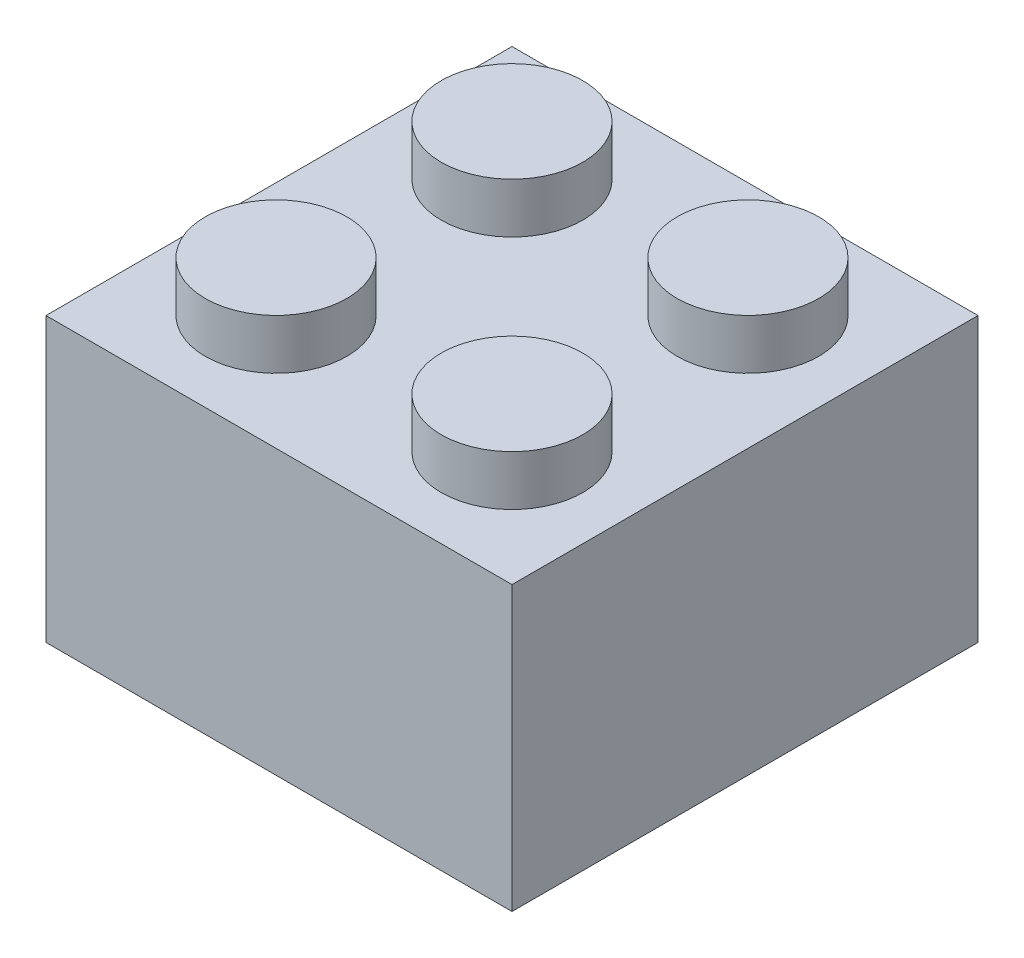
ISO-10303-21;
HEADER;
FILE_DESCRIPTION(('STEP AP214'),'2;1');
FILE_NAME('part.step','',(''),(''),'','','');
FILE_SCHEMA(('AUTOMOTIVE_DESIGN { 1 0 10303 214 1 1 1 1 }'));
ENDSEC;
DATA;
#1=APPLICATION_CONTEXT('core data for automotive mechanical design processes');
#2=APPLICATION_PROTOCOL_DEFINITION('international standard','automotive_design',2000,#1);
#3=PRODUCT_CONTEXT('',#1,'mechanical');
#4=PRODUCT('Part','Part','',(#3));
#5=PRODUCT_RELATED_PRODUCT_CATEGORY('part','',(#4));
#6=PRODUCT_DEFINITION_FORMATION('','',#4);
#7=PRODUCT_DEFINITION_CONTEXT('part definition',#1,'design');
#8=PRODUCT_DEFINITION('design','',#6,#7);
#9=PRODUCT_DEFINITION_SHAPE('','',#8);
#10=(LENGTH_UNIT() NAMED_UNIT(*) SI_UNIT(.MILLI.,.METRE.));
#11=(NAMED_UNIT(*) PLANE_ANGLE_UNIT() SI_UNIT($,.RADIAN.));
#12=(NAMED_UNIT(*) SI_UNIT($,.STERADIAN.) SOLID_ANGLE_UNIT());
#13=UNCERTAINTY_MEASURE_WITH_UNIT(LENGTH_MEASURE(1.E-05),#10,'distance_accuracy_value','');
#14=(GEOMETRIC_REPRESENTATION_CONTEXT(3) GLOBAL_UNCERTAINTY_ASSIGNED_CONTEXT((#13)) GLOBAL_UNIT_ASSIGNED_CONTEXT((#10,
#11,#12)) REPRESENTATION_CONTEXT('',''));
#15=CARTESIAN_POINT('',(0.,0.,0.));
#16=DIRECTION('',(0.,0.,1.));
#17=DIRECTION('',(1.,0.,0.));
#18=AXIS2_PLACEMENT_3D('',#15,#16,#17);
#19=CARTESIAN_POINT('',(0.,9.6,-15.8));
#20=DIRECTION('',(0.,0.,-1.));
#21=DIRECTION('',(-1.,0.,0.));
#22=AXIS2_PLACEMENT_3D('',#19,#20,#21);
#23=PLANE('',#22);
#24=DIRECTION('',(1.,0.,0.));
#25=VECTOR('',#24,1.);
#26=CARTESIAN_POINT('',(0.,0.,-15.8));
#27=LINE('',#26,#25);
#28=CARTESIAN_POINT('',(0.,0.,-15.8));
#29=VERTEX_POINT('',#28);
#30=CARTESIAN_POINT('',(15.8,0.,-15.8));
#31=VERTEX_POINT('',#30);
#32=EDGE_CURVE('E101',#29,#31,#27,.T.);
#33=ORIENTED_EDGE('',*,*,#32,.F.);
#34=DIRECTION('',(0.,-1.,0.));
#35=VECTOR('',#34,1.);
#36=CARTESIAN_POINT('',(0.,9.6,-15.8));
#37=LINE('',#36,#35);
#38=CARTESIAN_POINT('',(0.,9.6,-15.8));
#39=VERTEX_POINT('',#38);
#40=EDGE_CURVE('E11',#39,#29,#37,.T.);
#41=ORIENTED_EDGE('',*,*,#40,.F.);
#42=DIRECTION('',(1.,0.,0.));
#43=VECTOR('',#42,1.);
#44=CARTESIAN_POINT('',(0.,9.6,-15.8));
#45=LINE('',#44,#43);
#46=CARTESIAN_POINT('',(15.8,9.6,-15.8));
#47=VERTEX_POINT('',#46);
#48=EDGE_CURVE('E94',#39,#47,#45,.T.);
#49=ORIENTED_EDGE('',*,*,#48,.T.);
#50=DIRECTION('',(0.,-1.,0.));
#51=VECTOR('',#50,1.);
#52=CARTESIAN_POINT('',(15.8,9.6,-15.8));
#53=LINE('',#52,#51);
#54=EDGE_CURVE('E39',#47,#31,#53,.T.);
#55=ORIENTED_EDGE('',*,*,#54,.T.);
#56=EDGE_LOOP('',(#33,#41,#49,#55));
#57=FACE_BOUND('',#56,.T.);
#58=ADVANCED_FACE('F36',(#57),#23,.T.);
#59=CARTESIAN_POINT('',(0.,9.6,0.));
#60=DIRECTION('',(-1.,0.,0.));
#61=DIRECTION('',(0.,0.,1.));
#62=AXIS2_PLACEMENT_3D('',#59,#60,#61);
#63=PLANE('',#62);
#64=DIRECTION('',(0.,0.,-1.));
#65=VECTOR('',#64,1.);
#66=CARTESIAN_POINT('',(0.,0.,0.));
#67=LINE('',#66,#65);
#68=CARTESIAN_POINT('',(0.,0.,0.));
#69=VERTEX_POINT('',#68);
#70=EDGE_CURVE('E96',#69,#29,#67,.T.);
#71=ORIENTED_EDGE('',*,*,#70,.F.);
#72=DIRECTION('',(0.,-1.,0.));
#73=VECTOR('',#72,1.);
#74=CARTESIAN_POINT('',(0.,9.6,0.));
#75=LINE('',#74,#73);
#76=CARTESIAN_POINT('',(0.,9.6,0.));
#77=VERTEX_POINT('',#76);
#78=EDGE_CURVE('E45',#77,#69,#75,.T.);
#79=ORIENTED_EDGE('',*,*,#78,.F.);
#80=DIRECTION('',(0.,0.,-1.));
#81=VECTOR('',#80,1.);
#82=CARTESIAN_POINT('',(0.,9.6,0.));
#83=LINE('',#82,#81);
#84=EDGE_CURVE('E84',#77,#39,#83,.T.);
#85=ORIENTED_EDGE('',*,*,#84,.T.);
#86=ORIENTED_EDGE('',*,*,#40,.T.);
#87=EDGE_LOOP('',(#71,#79,#85,#86));
#88=FACE_BOUND('',#87,.T.);
#89=ADVANCED_FACE('F112',(#88),#63,.T.);
#90=CARTESIAN_POINT('',(0.,9.6,0.));
#91=DIRECTION('',(0.,0.,-1.));
#92=DIRECTION('',(-1.,0.,0.));
#93=AXIS2_PLACEMENT_3D('',#90,#91,#92);
#94=PLANE('',#93);
#95=DIRECTION('',(1.,0.,0.));
#96=VECTOR('',#95,1.);
#97=CARTESIAN_POINT('',(0.,0.,0.));
#98=LINE('',#97,#96);
#99=CARTESIAN_POINT('',(15.8,0.,0.));
#100=VERTEX_POINT('',#99);
#101=EDGE_CURVE('E89',#69,#100,#98,.T.);
#102=ORIENTED_EDGE('',*,*,#101,.T.);
#103=DIRECTION('',(0.,-1.,0.));
#104=VECTOR('',#103,1.);
#105=CARTESIAN_POINT('',(15.8,9.6,0.));
#106=LINE('',#105,#104);
#107=CARTESIAN_POINT('',(15.8,9.6,0.));
#108=VERTEX_POINT('',#107);
#109=EDGE_CURVE('E87',#108,#100,#106,.T.);
#110=ORIENTED_EDGE('',*,*,#109,.F.);
#111=DIRECTION('',(1.,0.,0.));
#112=VECTOR('',#111,1.);
#113=CARTESIAN_POINT('',(0.,9.6,0.));
#114=LINE('',#113,#112);
#115=EDGE_CURVE('E81',#77,#108,#114,.T.);
#116=ORIENTED_EDGE('',*,*,#115,.F.);
#117=ORIENTED_EDGE('',*,*,#78,.T.);
#118=EDGE_LOOP('',(#102,#110,#116,#117));
#119=FACE_BOUND('',#118,.T.);
#120=ADVANCED_FACE('F88',(#119),#94,.F.);
#121=CARTESIAN_POINT('',(15.8,9.6,0.));
#122=DIRECTION('',(-1.,0.,0.));
#123=DIRECTION('',(0.,0.,1.));
#124=AXIS2_PLACEMENT_3D('',#121,#122,#123);
#125=PLANE('',#124);
#126=DIRECTION('',(0.,0.,-1.));
#127=VECTOR('',#126,1.);
#128=CARTESIAN_POINT('',(15.8,0.,0.));
#129=LINE('',#128,#127);
#130=EDGE_CURVE('E104',#100,#31,#129,.T.);
#131=ORIENTED_EDGE('',*,*,#130,.T.);
#132=ORIENTED_EDGE('',*,*,#54,.F.);
#133=DIRECTION('',(0.,0.,-1.));
#134=VECTOR('',#133,1.);
#135=CARTESIAN_POINT('',(15.8,9.6,0.));
#136=LINE('',#135,#134);
#137=EDGE_CURVE('E78',#108,#47,#136,.T.);
#138=ORIENTED_EDGE('',*,*,#137,.F.);
#139=ORIENTED_EDGE('',*,*,#109,.T.);
#140=EDGE_LOOP('',(#131,#132,#138,#139));
#141=FACE_BOUND('',#140,.T.);
#142=ADVANCED_FACE('F93',(#141),#125,.F.);
#143=CARTESIAN_POINT('',(0.,9.6,0.));
#144=DIRECTION('',(0.,1.,0.));
#145=DIRECTION('',(0.,0.,1.));
#146=AXIS2_PLACEMENT_3D('',#143,#144,#145);
#147=PLANE('',#146);
#148=CARTESIAN_POINT('',(3.90000000000008,9.6,-3.9));
#149=DIRECTION('',(0.,1.,0.));
#150=DIRECTION('',(0.,0.,1.));
#151=AXIS2_PLACEMENT_3D('',#148,#149,#150);
#152=CIRCLE('',#151,2.4);
#153=CARTESIAN_POINT('',(3.90000000000008,9.6,-1.5));
#154=VERTEX_POINT('',#153);
#155=EDGE_CURVE('E224',#154,#154,#152,.T.);
#156=ORIENTED_EDGE('',*,*,#155,.F.);
#157=EDGE_LOOP('',(#156));
#158=FACE_BOUND('',#157,.T.);
#159=CARTESIAN_POINT('',(11.9000000000001,9.6,-3.9));
#160=DIRECTION('',(0.,1.,0.));
#161=DIRECTION('',(0.,0.,1.));
#162=AXIS2_PLACEMENT_3D('',#159,#160,#161);
#163=CIRCLE('',#162,2.4);
#164=CARTESIAN_POINT('',(11.9000000000001,9.6,-1.5));
#165=VERTEX_POINT('',#164);
#166=EDGE_CURVE('E229',#165,#165,#163,.T.);
#167=ORIENTED_EDGE('',*,*,#166,.F.);
#168=EDGE_LOOP('',(#167));
#169=FACE_BOUND('',#168,.T.);
#170=CARTESIAN_POINT('',(11.9,9.6,-11.9));
#171=DIRECTION('',(0.,1.,0.));
#172=DIRECTION('',(0.,0.,1.));
#173=AXIS2_PLACEMENT_3D('',#170,#171,#172);
#174=CIRCLE('',#173,2.4);
#175=CARTESIAN_POINT('',(11.9,9.6,-9.5));
#176=VERTEX_POINT('',#175);
#177=EDGE_CURVE('E235',#176,#176,#174,.T.);
#178=ORIENTED_EDGE('',*,*,#177,.F.);
#179=EDGE_LOOP('',(#178));
#180=FACE_BOUND('',#179,.T.);
#181=CARTESIAN_POINT('',(3.9,9.6,-11.9));
#182=DIRECTION('',(0.,1.,0.));
#183=DIRECTION('',(0.,0.,1.));
#184=AXIS2_PLACEMENT_3D('',#181,#182,#183);
#185=CIRCLE('',#184,2.4);
#186=CARTESIAN_POINT('',(3.9,9.6,-9.5));
#187=VERTEX_POINT('',#186);
#188=EDGE_CURVE('E241',#187,#187,#185,.T.);
#189=ORIENTED_EDGE('',*,*,#188,.F.);
#190=EDGE_LOOP('',(#189));
#191=FACE_BOUND('',#190,.T.);
#192=ORIENTED_EDGE('',*,*,#48,.F.);
#193=ORIENTED_EDGE('',*,*,#84,.F.);
#194=ORIENTED_EDGE('',*,*,#115,.T.);
#195=ORIENTED_EDGE('',*,*,#137,.T.);
#196=EDGE_LOOP('',(#192,#193,#194,#195));
#197=FACE_BOUND('',#196,.T.);
#198=ADVANCED_FACE('F83',(#158,#169,#180,#191,#197),#147,.T.);
#199=CARTESIAN_POINT('',(0.,0.,0.));
#200=DIRECTION('',(0.,1.,0.));
#201=DIRECTION('',(0.,0.,1.));
#202=AXIS2_PLACEMENT_3D('',#199,#200,#201);
#203=PLANE('',#202);
#204=CARTESIAN_POINT('',(11.9000000000001,0.,-11.9));
#205=DIRECTION('',(0.,-1.,0.));
#206=DIRECTION('',(0.,0.,-1.));
#207=AXIS2_PLACEMENT_3D('',#204,#205,#206);
#208=CIRCLE('',#207,2.5);
#209=CARTESIAN_POINT('',(11.9000000000001,0.,-14.4));
#210=VERTEX_POINT('',#209);
#211=EDGE_CURVE('E220',#210,#210,#208,.T.);
#212=ORIENTED_EDGE('',*,*,#211,.F.);
#213=EDGE_LOOP('',(#212));
#214=FACE_BOUND('',#213,.T.);
#215=CARTESIAN_POINT('',(3.90000000000008,0.,-11.9000000000001));
#216=DIRECTION('',(0.,-1.,0.));
#217=DIRECTION('',(0.,0.,-1.));
#218=AXIS2_PLACEMENT_3D('',#215,#216,#217);
#219=CIRCLE('',#218,2.5);
#220=CARTESIAN_POINT('',(3.90000000000008,0.,-14.4000000000001));
#221=VERTEX_POINT('',#220);
#222=EDGE_CURVE('E214',#221,#221,#219,.T.);
#223=ORIENTED_EDGE('',*,*,#222,.F.);
#224=EDGE_LOOP('',(#223));
#225=FACE_BOUND('',#224,.T.);
#226=CARTESIAN_POINT('',(3.9,0.,-3.90000000000006));
#227=DIRECTION('',(0.,-1.,0.));
#228=DIRECTION('',(0.,0.,-1.));
#229=AXIS2_PLACEMENT_3D('',#226,#227,#228);
#230=CIRCLE('',#229,2.5);
#231=CARTESIAN_POINT('',(3.9,0.,-6.40000000000005));
#232=VERTEX_POINT('',#231);
#233=EDGE_CURVE('E203',#232,#232,#230,.T.);
#234=ORIENTED_EDGE('',*,*,#233,.F.);
#235=EDGE_LOOP('',(#234));
#236=FACE_BOUND('',#235,.T.);
#237=CARTESIAN_POINT('',(11.9,0.,-3.9));
#238=DIRECTION('',(0.,-1.,0.));
#239=DIRECTION('',(0.,0.,-1.));
#240=AXIS2_PLACEMENT_3D('',#237,#238,#239);
#241=CIRCLE('',#240,2.5);
#242=CARTESIAN_POINT('',(11.9,0.,-6.4));
#243=VERTEX_POINT('',#242);
#244=EDGE_CURVE('E202',#243,#243,#241,.T.);
#245=ORIENTED_EDGE('',*,*,#244,.F.);
#246=EDGE_LOOP('',(#245));
#247=FACE_BOUND('',#246,.T.);
#248=ORIENTED_EDGE('',*,*,#32,.T.);
#249=ORIENTED_EDGE('',*,*,#130,.F.);
#250=ORIENTED_EDGE('',*,*,#101,.F.);
#251=ORIENTED_EDGE('',*,*,#70,.T.);
#252=EDGE_LOOP('',(#248,#249,#250,#251));
#253=FACE_BOUND('',#252,.T.);
#254=ADVANCED_FACE('F111',(#214,#225,#236,#247,#253),#203,.F.);
#255=CARTESIAN_POINT('',(3.9,11.3,-11.9));
#256=DIRECTION('',(0.,-1.,0.));
#257=DIRECTION('',(0.,0.,-1.));
#258=AXIS2_PLACEMENT_3D('',#255,#256,#257);
#259=CYLINDRICAL_SURFACE('',#258,2.4);
#260=CARTESIAN_POINT('',(3.9,11.3,-11.9));
#261=DIRECTION('',(0.,1.,0.));
#262=DIRECTION('',(0.,0.,1.));
#263=AXIS2_PLACEMENT_3D('',#260,#261,#262);
#264=CIRCLE('',#263,2.4);
#265=CARTESIAN_POINT('',(3.9,11.3,-9.5));
#266=VERTEX_POINT('',#265);
#267=EDGE_CURVE('E105',#266,#266,#264,.T.);
#268=ORIENTED_EDGE('',*,*,#267,.F.);
#269=EDGE_LOOP('',(#268));
#270=FACE_BOUND('',#269,.T.);
#271=ORIENTED_EDGE('',*,*,#188,.T.);
#272=EDGE_LOOP('',(#271));
#273=FACE_BOUND('',#272,.T.);
#274=ADVANCED_FACE('F130',(#270,#273),#259,.T.);
#275=CARTESIAN_POINT('',(3.9,11.3,-11.9));
#276=DIRECTION('',(0.,1.,0.));
#277=DIRECTION('',(0.,0.,1.));
#278=AXIS2_PLACEMENT_3D('',#275,#276,#277);
#279=PLANE('',#278);
#280=ORIENTED_EDGE('',*,*,#267,.T.);
#281=EDGE_LOOP('',(#280));
#282=FACE_BOUND('',#281,.T.);
#283=ADVANCED_FACE('F137',(#282),#279,.T.);
#284=CARTESIAN_POINT('',(11.9,11.3,-11.9));
#285=DIRECTION('',(0.,-1.,0.));
#286=DIRECTION('',(0.,0.,-1.));
#287=AXIS2_PLACEMENT_3D('',#284,#285,#286);
#288=CYLINDRICAL_SURFACE('',#287,2.4);
#289=CARTESIAN_POINT('',(11.9,11.3,-11.9));
#290=DIRECTION('',(0.,1.,0.));
#291=DIRECTION('',(0.,0.,1.));
#292=AXIS2_PLACEMENT_3D('',#289,#290,#291);
#293=CIRCLE('',#292,2.4);
#294=CARTESIAN_POINT('',(11.9,11.3,-9.5));
#295=VERTEX_POINT('',#294);
#296=EDGE_CURVE('E238',#295,#295,#293,.T.);
#297=ORIENTED_EDGE('',*,*,#296,.F.);
#298=EDGE_LOOP('',(#297));
#299=FACE_BOUND('',#298,.T.);
#300=ORIENTED_EDGE('',*,*,#177,.T.);
#301=EDGE_LOOP('',(#300));
#302=FACE_BOUND('',#301,.T.);
#303=ADVANCED_FACE('F141',(#299,#302),#288,.T.);
#304=CARTESIAN_POINT('',(11.9,11.3,-11.9));
#305=DIRECTION('',(0.,1.,0.));
#306=DIRECTION('',(0.,0.,1.));
#307=AXIS2_PLACEMENT_3D('',#304,#305,#306);
#308=PLANE('',#307);
#309=ORIENTED_EDGE('',*,*,#296,.T.);
#310=EDGE_LOOP('',(#309));
#311=FACE_BOUND('',#310,.T.);
#312=ADVANCED_FACE('F145',(#311),#308,.T.);
#313=CARTESIAN_POINT('',(11.9000000000001,11.3,-3.9));
#314=DIRECTION('',(0.,-1.,0.));
#315=DIRECTION('',(0.,0.,-1.));
#316=AXIS2_PLACEMENT_3D('',#313,#314,#315);
#317=CYLINDRICAL_SURFACE('',#316,2.4);
#318=CARTESIAN_POINT('',(11.9000000000001,11.3,-3.9));
#319=DIRECTION('',(0.,1.,0.));
#320=DIRECTION('',(0.,0.,1.));
#321=AXIS2_PLACEMENT_3D('',#318,#319,#320);
#322=CIRCLE('',#321,2.4);
#323=CARTESIAN_POINT('',(11.9000000000001,11.3,-1.5));
#324=VERTEX_POINT('',#323);
#325=EDGE_CURVE('E232',#324,#324,#322,.T.);
#326=ORIENTED_EDGE('',*,*,#325,.F.);
#327=EDGE_LOOP('',(#326));
#328=FACE_BOUND('',#327,.T.);
#329=ORIENTED_EDGE('',*,*,#166,.T.);
#330=EDGE_LOOP('',(#329));
#331=FACE_BOUND('',#330,.T.);
#332=ADVANCED_FACE('F149',(#328,#331),#317,.T.);
#333=CARTESIAN_POINT('',(11.9000000000001,11.3,-3.9));
#334=DIRECTION('',(0.,1.,0.));
#335=DIRECTION('',(0.,0.,1.));
#336=AXIS2_PLACEMENT_3D('',#333,#334,#335);
#337=PLANE('',#336);
#338=ORIENTED_EDGE('',*,*,#325,.T.);
#339=EDGE_LOOP('',(#338));
#340=FACE_BOUND('',#339,.T.);
#341=ADVANCED_FACE('F153',(#340),#337,.T.);
#342=CARTESIAN_POINT('',(3.90000000000008,11.3,-3.9));
#343=DIRECTION('',(0.,-1.,0.));
#344=DIRECTION('',(0.,0.,-1.));
#345=AXIS2_PLACEMENT_3D('',#342,#343,#344);
#346=CYLINDRICAL_SURFACE('',#345,2.4);
#347=CARTESIAN_POINT('',(3.90000000000008,11.3,-3.9));
#348=DIRECTION('',(0.,1.,0.));
#349=DIRECTION('',(0.,0.,1.));
#350=AXIS2_PLACEMENT_3D('',#347,#348,#349);
#351=CIRCLE('',#350,2.4);
#352=CARTESIAN_POINT('',(3.90000000000008,11.3,-1.5));
#353=VERTEX_POINT('',#352);
#354=EDGE_CURVE('E226',#353,#353,#351,.T.);
#355=ORIENTED_EDGE('',*,*,#354,.F.);
#356=EDGE_LOOP('',(#355));
#357=FACE_BOUND('',#356,.T.);
#358=ORIENTED_EDGE('',*,*,#155,.T.);
#359=EDGE_LOOP('',(#358));
#360=FACE_BOUND('',#359,.T.);
#361=ADVANCED_FACE('F157',(#357,#360),#346,.T.);
#362=CARTESIAN_POINT('',(3.90000000000008,11.3,-3.9));
#363=DIRECTION('',(0.,1.,0.));
#364=DIRECTION('',(0.,0.,1.));
#365=AXIS2_PLACEMENT_3D('',#362,#363,#364);
#366=PLANE('',#365);
#367=ORIENTED_EDGE('',*,*,#354,.T.);
#368=EDGE_LOOP('',(#367));
#369=FACE_BOUND('',#368,.T.);
#370=ADVANCED_FACE('F161',(#369),#366,.T.);
#371=CARTESIAN_POINT('',(11.9,1.8,-3.9));
#372=DIRECTION('',(0.,-1.,0.));
#373=DIRECTION('',(0.,0.,-1.));
#374=AXIS2_PLACEMENT_3D('',#371,#372,#373);
#375=CYLINDRICAL_SURFACE('',#374,2.5);
#376=CARTESIAN_POINT('',(11.9,1.8,-3.9));
#377=DIRECTION('',(0.,-1.,0.));
#378=DIRECTION('',(0.,0.,-1.));
#379=AXIS2_PLACEMENT_3D('',#376,#377,#378);
#380=CIRCLE('',#379,2.5);
#381=CARTESIAN_POINT('',(11.9,1.8,-6.4));
#382=VERTEX_POINT('',#381);
#383=EDGE_CURVE('E206',#382,#382,#380,.T.);
#384=ORIENTED_EDGE('',*,*,#383,.F.);
#385=EDGE_LOOP('',(#384));
#386=FACE_BOUND('',#385,.T.);
#387=ORIENTED_EDGE('',*,*,#244,.T.);
#388=EDGE_LOOP('',(#387));
#389=FACE_BOUND('',#388,.T.);
#390=ADVANCED_FACE('F165',(#386,#389),#375,.F.);
#391=CARTESIAN_POINT('',(11.9,1.8,-3.9));
#392=DIRECTION('',(0.,-1.,0.));
#393=DIRECTION('',(0.,0.,-1.));
#394=AXIS2_PLACEMENT_3D('',#391,#392,#393);
#395=PLANE('',#394);
#396=ORIENTED_EDGE('',*,*,#383,.T.);
#397=EDGE_LOOP('',(#396));
#398=FACE_BOUND('',#397,.T.);
#399=ADVANCED_FACE('F169',(#398),#395,.T.);
#400=CARTESIAN_POINT('',(3.9,1.8,-3.90000000000006));
#401=DIRECTION('',(0.,-1.,0.));
#402=DIRECTION('',(0.,0.,-1.));
#403=AXIS2_PLACEMENT_3D('',#400,#401,#402);
#404=CYLINDRICAL_SURFACE('',#403,2.5);
#405=CARTESIAN_POINT('',(3.9,1.8,-3.90000000000006));
#406=DIRECTION('',(0.,-1.,0.));
#407=DIRECTION('',(0.,0.,-1.));
#408=AXIS2_PLACEMENT_3D('',#405,#406,#407);
#409=CIRCLE('',#408,2.5);
#410=CARTESIAN_POINT('',(3.9,1.8,-6.40000000000005));
#411=VERTEX_POINT('',#410);
#412=EDGE_CURVE('E201',#411,#411,#409,.T.);
#413=ORIENTED_EDGE('',*,*,#412,.F.);
#414=EDGE_LOOP('',(#413));
#415=FACE_BOUND('',#414,.T.);
#416=ORIENTED_EDGE('',*,*,#233,.T.);
#417=EDGE_LOOP('',(#416));
#418=FACE_BOUND('',#417,.T.);
#419=ADVANCED_FACE('F173',(#415,#418),#404,.F.);
#420=CARTESIAN_POINT('',(3.9,1.8,-3.90000000000006));
#421=DIRECTION('',(0.,-1.,0.));
#422=DIRECTION('',(0.,0.,-1.));
#423=AXIS2_PLACEMENT_3D('',#420,#421,#422);
#424=PLANE('',#423);
#425=ORIENTED_EDGE('',*,*,#412,.T.);
#426=EDGE_LOOP('',(#425));
#427=FACE_BOUND('',#426,.T.);
#428=ADVANCED_FACE('F187',(#427),#424,.T.);
#429=CARTESIAN_POINT('',(3.90000000000008,1.8,-11.9000000000001));
#430=DIRECTION('',(0.,-1.,0.));
#431=DIRECTION('',(0.,0.,-1.));
#432=AXIS2_PLACEMENT_3D('',#429,#430,#431);
#433=CYLINDRICAL_SURFACE('',#432,2.5);
#434=CARTESIAN_POINT('',(3.90000000000008,1.8,-11.9000000000001));
#435=DIRECTION('',(0.,-1.,0.));
#436=DIRECTION('',(0.,0.,-1.));
#437=AXIS2_PLACEMENT_3D('',#434,#435,#436);
#438=CIRCLE('',#437,2.5);
#439=CARTESIAN_POINT('',(3.90000000000008,1.8,-14.4000000000001));
#440=VERTEX_POINT('',#439);
#441=EDGE_CURVE('E209',#440,#440,#438,.T.);
#442=ORIENTED_EDGE('',*,*,#441,.F.);
#443=EDGE_LOOP('',(#442));
#444=FACE_BOUND('',#443,.T.);
#445=ORIENTED_EDGE('',*,*,#222,.T.);
#446=EDGE_LOOP('',(#445));
#447=FACE_BOUND('',#446,.T.);
#448=ADVANCED_FACE('F184',(#444,#447),#433,.F.);
#449=CARTESIAN_POINT('',(3.90000000000008,1.8,-11.9000000000001));
#450=DIRECTION('',(0.,-1.,0.));
#451=DIRECTION('',(0.,0.,-1.));
#452=AXIS2_PLACEMENT_3D('',#449,#450,#451);
#453=PLANE('',#452);
#454=ORIENTED_EDGE('',*,*,#441,.T.);
#455=EDGE_LOOP('',(#454));
#456=FACE_BOUND('',#455,.T.);
#457=ADVANCED_FACE('F179',(#456),#453,.T.);
#458=CARTESIAN_POINT('',(11.9000000000001,1.8,-11.9));
#459=DIRECTION('',(0.,-1.,0.));
#460=DIRECTION('',(0.,0.,-1.));
#461=AXIS2_PLACEMENT_3D('',#458,#459,#460);
#462=CYLINDRICAL_SURFACE('',#461,2.5);
#463=CARTESIAN_POINT('',(11.9000000000001,1.8,-11.9));
#464=DIRECTION('',(0.,-1.,0.));
#465=DIRECTION('',(0.,0.,-1.));
#466=AXIS2_PLACEMENT_3D('',#463,#464,#465);
#467=CIRCLE('',#466,2.5);
#468=CARTESIAN_POINT('',(11.9000000000001,1.8,-14.4));
#469=VERTEX_POINT('',#468);
#470=EDGE_CURVE('E217',#469,#469,#467,.T.);
#471=ORIENTED_EDGE('',*,*,#470,.F.);
#472=EDGE_LOOP('',(#471));
#473=FACE_BOUND('',#472,.T.);
#474=ORIENTED_EDGE('',*,*,#211,.T.);
#475=EDGE_LOOP('',(#474));
#476=FACE_BOUND('',#475,.T.);
#477=ADVANCED_FACE('F175',(#473,#476),#462,.F.);
#478=CARTESIAN_POINT('',(11.9000000000001,1.8,-11.9));
#479=DIRECTION('',(0.,-1.,0.));
#480=DIRECTION('',(0.,0.,-1.));
#481=AXIS2_PLACEMENT_3D('',#478,#479,#480);
#482=PLANE('',#481);
#483=ORIENTED_EDGE('',*,*,#470,.T.);
#484=EDGE_LOOP('',(#483));
#485=FACE_BOUND('',#484,.T.);
#486=ADVANCED_FACE('F178',(#485),#482,.T.);
#487=CLOSED_SHELL('',(#58,#89,#120,#142,#198,#254,#274,#283,#303,#312,#332,#341,#361,#370,#390,
#399,#419,#428,#448,#457,#477,#486));
#488=MANIFOLD_SOLID_BREP('B2',#487);
#489=ADVANCED_BREP_SHAPE_REPRESENTATION('',(#18,#488),#14);
#490=SHAPE_DEFINITION_REPRESENTATION(#9,#489);
ENDSEC;
END-ISO-10303-21;
